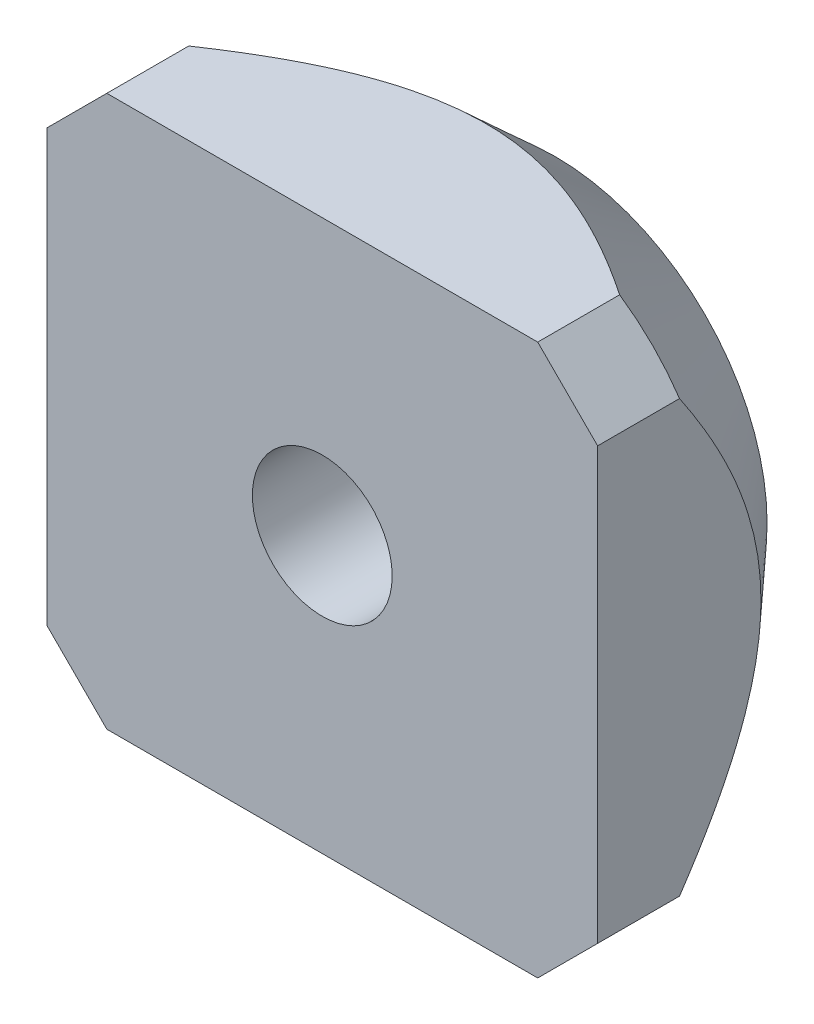
ISO-10303-21;
HEADER;
FILE_DESCRIPTION(('STEP AP214'),'2;1');
FILE_NAME('part.step','',(''),(''),'','','');
FILE_SCHEMA(('AUTOMOTIVE_DESIGN { 1 0 10303 214 1 1 1 1 }'));
ENDSEC;
DATA;
#1=APPLICATION_CONTEXT('core data for automotive mechanical design processes');
#2=APPLICATION_PROTOCOL_DEFINITION('international standard','automotive_design',2000,#1);
#3=PRODUCT_CONTEXT('',#1,'mechanical');
#4=PRODUCT('Part','Part','',(#3));
#5=PRODUCT_RELATED_PRODUCT_CATEGORY('part','',(#4));
#6=PRODUCT_DEFINITION_FORMATION('','',#4);
#7=PRODUCT_DEFINITION_CONTEXT('part definition',#1,'design');
#8=PRODUCT_DEFINITION('design','',#6,#7);
#9=PRODUCT_DEFINITION_SHAPE('','',#8);
#10=(LENGTH_UNIT() NAMED_UNIT(*) SI_UNIT(.MILLI.,.METRE.));
#11=(NAMED_UNIT(*) PLANE_ANGLE_UNIT() SI_UNIT($,.RADIAN.));
#12=(NAMED_UNIT(*) SI_UNIT($,.STERADIAN.) SOLID_ANGLE_UNIT());
#13=UNCERTAINTY_MEASURE_WITH_UNIT(LENGTH_MEASURE(1.E-05),#10,'distance_accuracy_value','');
#14=(GEOMETRIC_REPRESENTATION_CONTEXT(3) GLOBAL_UNCERTAINTY_ASSIGNED_CONTEXT((#13)) GLOBAL_UNIT_ASSIGNED_CONTEXT((#10,
#11,#12)) REPRESENTATION_CONTEXT('',''));
#15=CARTESIAN_POINT('',(0.,0.,0.));
#16=DIRECTION('',(0.,0.,1.));
#17=DIRECTION('',(1.,0.,0.));
#18=AXIS2_PLACEMENT_3D('',#15,#16,#17);
#19=CARTESIAN_POINT('',(0.,0.,-5.5));
#20=DIRECTION('',(0.,0.,1.));
#21=DIRECTION('',(1.,0.,0.));
#22=AXIS2_PLACEMENT_3D('',#19,#20,#21);
#23=PLANE('',#22);
#24=CARTESIAN_POINT('',(0.,0.,-5.5));
#25=DIRECTION('',(0.,0.,1.));
#26=DIRECTION('',(1.,0.,0.));
#27=AXIS2_PLACEMENT_3D('',#24,#25,#26);
#28=CIRCLE('',#27,1.65);
#29=CARTESIAN_POINT('',(1.65,0.,-5.5));
#30=VERTEX_POINT('',#29);
#31=EDGE_CURVE('E246',#30,#30,#28,.T.);
#32=ORIENTED_EDGE('',*,*,#31,.T.);
#33=EDGE_LOOP('',(#32));
#34=FACE_BOUND('',#33,.T.);
#35=CARTESIAN_POINT('',(0.,0.,-5.50000000287154));
#36=DIRECTION('',(0.,0.,1.));
#37=DIRECTION('',(1.,0.,0.));
#38=AXIS2_PLACEMENT_3D('',#35,#36,#37);
#39=CIRCLE('',#38,5.00000000314824);
#40=CARTESIAN_POINT('',(5.00000000314824,0.,-5.50000000287154));
#41=VERTEX_POINT('',#40);
#42=EDGE_CURVE('E33',#41,#41,#39,.T.);
#43=ORIENTED_EDGE('',*,*,#42,.F.);
#44=EDGE_LOOP('',(#43));
#45=FACE_BOUND('',#44,.T.);
#46=ADVANCED_FACE('F30',(#34,#45),#23,.F.);
#47=CARTESIAN_POINT('',(0.,0.,-1.91193420733516));
#48=DIRECTION('',(0.,0.,1.));
#49=DIRECTION('',(1.,0.,0.));
#50=AXIS2_PLACEMENT_3D('',#47,#48,#49);
#51=CONICAL_SURFACE('',#50,8.27271392518171,0.739466056088912);
#52=ORIENTED_EDGE('',*,*,#42,.T.);
#53=EDGE_LOOP('',(#52));
#54=FACE_BOUND('',#53,.T.);
#55=CARTESIAN_POINT('',(-6.49999999996656,5.08578643774263,-1.93333420218814));
#56=CARTESIAN_POINT('',(-6.49999999998799,4.97217656549041,-2.01007902749409));
#57=CARTESIAN_POINT('',(-6.49999999999678,4.85782950972393,-2.08574579284289));
#58=CARTESIAN_POINT('',(-6.50000000000322,4.62749756275461,-2.23459577320099));
#59=CARTESIAN_POINT('',(-6.50000000000086,4.51151233122406,-2.30777846107305));
#60=CARTESIAN_POINT('',(-6.49999999999913,4.27735001893202,-2.45156937006614));
#61=CARTESIAN_POINT('',(-6.49999999999976,4.15916634847437,-2.52216690472437));
#62=CARTESIAN_POINT('',(-6.50000000000024,3.92090179825337,-2.66006146574261));
#63=CARTESIAN_POINT('',(-6.50000000000008,3.80082102170299,-2.72735867084667));
#64=CARTESIAN_POINT('',(-6.49999999999983,3.43117049901182,-2.927024197621));
#65=CARTESIAN_POINT('',(-6.49999999999995,3.17828163281151,-3.05336340735418));
#66=CARTESIAN_POINT('',(-6.50000000000004,2.66320472724055,-3.2847897494762));
#67=CARTESIAN_POINT('',(-6.50000000000001,2.40103115726329,-3.38990837532806));
#68=CARTESIAN_POINT('',(-6.49999999999999,1.96194937878003,-3.54007016332442));
#69=CARTESIAN_POINT('',(-6.5,1.78780916432668,-3.5931930058844));
#70=CARTESIAN_POINT('',(-6.5,1.43593803357401,-3.68604206605222));
#71=CARTESIAN_POINT('',(-6.5,1.25820705951024,-3.72576806796325));
#72=CARTESIAN_POINT('',(-6.5,0.901971243864608,-3.78972854936986));
#73=CARTESIAN_POINT('',(-6.5,0.723496609813822,-3.81412921930872));
#74=CARTESIAN_POINT('',(-6.5,0.365074863040264,-3.84691624104865));
#75=CARTESIAN_POINT('',(-6.5,0.185127876429945,-3.85530395029257));
#76=CARTESIAN_POINT('',(-6.5,-0.175331996863656,-3.85561829853934));
#77=CARTESIAN_POINT('',(-6.5,-0.355844930170432,-3.84749448568778));
#78=CARTESIAN_POINT('',(-6.5,-0.715412000901114,-3.81512247996494));
#79=CARTESIAN_POINT('',(-6.5,-0.894466007670494,-3.79087285866508));
#80=CARTESIAN_POINT('',(-6.5,-1.25186987190293,-3.72710369302864));
#81=CARTESIAN_POINT('',(-6.5,-1.43018938883302,-3.6874161876482));
#82=CARTESIAN_POINT('',(-6.5,-1.7832209983363,-3.59454247061222));
#83=CARTESIAN_POINT('',(-6.5,-1.95793314761956,-3.54135647133646));
#84=CARTESIAN_POINT('',(-6.5,-2.39791270686289,-3.39110767153733));
#85=CARTESIAN_POINT('',(-6.5,-2.66041462883235,-3.2859613732665));
#86=CARTESIAN_POINT('',(-6.5,-3.17612601907367,-3.05441341529704));
#87=CARTESIAN_POINT('',(-6.5,-3.4293209389517,-2.92798006949308));
#88=CARTESIAN_POINT('',(-6.5,-3.79940591229883,-2.72814379751195));
#89=CARTESIAN_POINT('',(-6.5,-3.91962359960432,-2.66078705978884));
#90=CARTESIAN_POINT('',(-6.5,-4.15815744619399,-2.52276484072712));
#91=CARTESIAN_POINT('',(-6.5,-4.27647350172637,-2.45209917967338));
#92=CARTESIAN_POINT('',(-6.5,-4.510894297226,-2.30816632365151));
#93=CARTESIAN_POINT('',(-6.5,-4.62700566745187,-2.23490988206234));
#94=CARTESIAN_POINT('',(-6.5,-4.85758619181249,-2.08590677964123));
#95=CARTESIAN_POINT('',(-6.5,-4.97205568825616,-2.01016064904319));
#96=CARTESIAN_POINT('',(-6.5,-5.08578643774838,-1.93333420220499));
#97=B_SPLINE_CURVE_WITH_KNOTS('',3,(#55,#56,#57,#58,#59,#60,#61,#62,#63,#64,#65,#66,#67,#68,#69,
#70,#71,#72,#73,#74,#75,#76,#77,#78,#79,#80,#81,#82,#83,#84,#85,#86,#87,#88,#89,#90,#91,#92,#93,
#94,#95,#96),.UNSPECIFIED.,.F.,.F.,(4,2,2,2,2,2,2,2,2,2,2,2,2,2,2,2,2,2,2,2,4),(0.,
0.41131042679013,0.822707597462602,1.23564791332838,1.64856583981778,2.49590493844257,
3.34197710361053,3.88772071571207,4.43347311417834,4.97320018567055,5.51288150165221,
6.05421432221896,6.59559510058552,7.1430386002873,7.69047348727104,8.53748456918338,
9.38576777125056,9.79913116863559,10.2125170428237,10.6243522063669,11.0361002217524),.UNSPECIFIED.);
#98=CARTESIAN_POINT('',(-6.50000000001247,5.08578643767711,-1.93333420224238));
#99=VERTEX_POINT('',#98);
#100=CARTESIAN_POINT('',(-6.50000000001247,-5.08578643767711,-1.93333420224238));
#101=VERTEX_POINT('',#100);
#102=EDGE_CURVE('E159',#99,#101,#97,.T.);
#103=ORIENTED_EDGE('',*,*,#102,.F.);
#104=CARTESIAN_POINT('',(-5.08578643758324,6.50000000000418,-1.93333420227152));
#105=CARTESIAN_POINT('',(-5.20320338743552,6.38258305017716,-1.95544496406807));
#106=CARTESIAN_POINT('',(-5.32114245529566,6.26464398232743,-1.97213629505099));
#107=CARTESIAN_POINT('',(-5.55702028333326,6.02876615429746,-1.99438943436884));
#108=CARTESIAN_POINT('',(-5.6749567510727,5.9108296865553,-2.00000000038364));
#109=CARTESIAN_POINT('',(-5.91082968655301,5.67495675107281,-2.00000000038308));
#110=CARTESIAN_POINT('',(-6.02876615429389,5.55702028333248,-1.99438943436772));
#111=CARTESIAN_POINT('',(-6.2646439823281,5.32114245529936,-1.97213629505239));
#112=CARTESIAN_POINT('',(-6.38258305018337,5.20320338744464,-1.95544496407257));
#113=CARTESIAN_POINT('',(-6.50000000002287,5.08578643760404,-1.93333420228277));
#114=B_SPLINE_CURVE_WITH_KNOTS('',3,(#104,#105,#106,#107,#108,#109,#110,#111,#112,#113),
.UNSPECIFIED.,.F.,.F.,(4,2,2,2,4),(0.,0.502492195093159,1.00276834929097,1.50304450348823,
2.00553669858084),.UNSPECIFIED.);
#115=CARTESIAN_POINT('',(-5.08578643767711,6.50000000001248,-1.93333420224238));
#116=VERTEX_POINT('',#115);
#117=EDGE_CURVE('E165',#116,#99,#114,.T.);
#118=ORIENTED_EDGE('',*,*,#117,.F.);
#119=CARTESIAN_POINT('',(5.08578643774263,6.49999999996657,-1.93333420218813));
#120=CARTESIAN_POINT('',(4.9721765654904,6.49999999998799,-2.01007902749409));
#121=CARTESIAN_POINT('',(4.85782950972392,6.49999999999678,-2.08574579284289));
#122=CARTESIAN_POINT('',(4.62749756275461,6.50000000000322,-2.23459577320099));
#123=CARTESIAN_POINT('',(4.51151233122406,6.50000000000087,-2.30777846107305));
#124=CARTESIAN_POINT('',(4.27735001893202,6.49999999999913,-2.45156937006614));
#125=CARTESIAN_POINT('',(4.15916634847437,6.49999999999976,-2.52216690472436));
#126=CARTESIAN_POINT('',(3.92090179825336,6.50000000000024,-2.66006146574261));
#127=CARTESIAN_POINT('',(3.80082102170299,6.50000000000009,-2.72735867084667));
#128=CARTESIAN_POINT('',(3.43117049901181,6.49999999999983,-2.927024197621));
#129=CARTESIAN_POINT('',(3.17828163281151,6.49999999999996,-3.05336340735418));
#130=CARTESIAN_POINT('',(2.66320472724054,6.50000000000005,-3.2847897494762));
#131=CARTESIAN_POINT('',(2.40103115726328,6.50000000000001,-3.38990837532806));
#132=CARTESIAN_POINT('',(1.96194937878002,6.5,-3.54007016332442));
#133=CARTESIAN_POINT('',(1.78780916432667,6.5,-3.5931930058844));
#134=CARTESIAN_POINT('',(1.435938033574,6.50000000000001,-3.68604206605221));
#135=CARTESIAN_POINT('',(1.25820705951023,6.5,-3.72576806796325));
#136=CARTESIAN_POINT('',(0.901971243864601,6.5,-3.78972854936986));
#137=CARTESIAN_POINT('',(0.723496609813815,6.5,-3.81412921930872));
#138=CARTESIAN_POINT('',(0.365074863040257,6.5,-3.84691624104865));
#139=CARTESIAN_POINT('',(0.185127876429939,6.5,-3.85530395029256));
#140=CARTESIAN_POINT('',(-0.175331996863662,6.5,-3.85561829853934));
#141=CARTESIAN_POINT('',(-0.355844930170438,6.5,-3.84749448568778));
#142=CARTESIAN_POINT('',(-0.715412000901119,6.5,-3.81512247996494));
#143=CARTESIAN_POINT('',(-0.8944660076705,6.5,-3.79087285866508));
#144=CARTESIAN_POINT('',(-1.25186987190293,6.5,-3.72710369302863));
#145=CARTESIAN_POINT('',(-1.43018938883303,6.5,-3.68741618764819));
#146=CARTESIAN_POINT('',(-1.7832209983363,6.5,-3.59454247061221));
#147=CARTESIAN_POINT('',(-1.95793314761956,6.5,-3.54135647133646));
#148=CARTESIAN_POINT('',(-2.3979127068629,6.5,-3.39110767153733));
#149=CARTESIAN_POINT('',(-2.66041462883235,6.5,-3.2859613732665));
#150=CARTESIAN_POINT('',(-3.17612601907368,6.5,-3.05441341529704));
#151=CARTESIAN_POINT('',(-3.4293209389517,6.5,-2.92798006949307));
#152=CARTESIAN_POINT('',(-3.79940591229883,6.5,-2.72814379751195));
#153=CARTESIAN_POINT('',(-3.91962359960432,6.5,-2.66078705978884));
#154=CARTESIAN_POINT('',(-4.15815744619399,6.5,-2.52276484072712));
#155=CARTESIAN_POINT('',(-4.27647350172636,6.5,-2.45209917967338));
#156=CARTESIAN_POINT('',(-4.510894297226,6.5,-2.30816632365151));
#157=CARTESIAN_POINT('',(-4.62700566745187,6.5,-2.23490988206234));
#158=CARTESIAN_POINT('',(-4.85758619181248,6.5,-2.08590677964123));
#159=CARTESIAN_POINT('',(-4.97205568825616,6.5,-2.01016064904319));
#160=CARTESIAN_POINT('',(-5.08578643774838,6.5,-1.93333420220499));
#161=B_SPLINE_CURVE_WITH_KNOTS('',3,(#119,#120,#121,#122,#123,#124,#125,#126,#127,#128,#129,
#130,#131,#132,#133,#134,#135,#136,#137,#138,#139,#140,#141,#142,#143,#144,#145,#146,#147,#148,
#149,#150,#151,#152,#153,#154,#155,#156,#157,#158,#159,#160),.UNSPECIFIED.,.F.,.F.,(4,2,2,2,2,2,
2,2,2,2,2,2,2,2,2,2,2,2,2,2,4),(0.,0.411310426790131,0.822707597462601,1.23564791332838,
1.64856583981778,2.49590493844257,3.34197710361053,3.88772071571208,4.43347311417834,
4.97320018567055,5.51288150165221,6.05421432221896,6.59559510058552,7.1430386002873,
7.69047348727104,8.53748456918337,9.38576777125056,9.79913116863558,10.2125170428237,
10.6243522063669,11.0361002217524),.UNSPECIFIED.);
#162=CARTESIAN_POINT('',(5.08578643767711,6.50000000001247,-1.93333420224238));
#163=VERTEX_POINT('',#162);
#164=EDGE_CURVE('E99',#163,#116,#161,.T.);
#165=ORIENTED_EDGE('',*,*,#164,.F.);
#166=CARTESIAN_POINT('',(6.50000000000418,5.08578643758324,-1.93333420227152));
#167=CARTESIAN_POINT('',(6.38258305017715,5.20320338743553,-1.95544496406807));
#168=CARTESIAN_POINT('',(6.26464398232743,5.32114245529566,-1.97213629505098));
#169=CARTESIAN_POINT('',(6.02876615429745,5.55702028333326,-1.99438943436883));
#170=CARTESIAN_POINT('',(5.9108296865553,5.6749567510727,-2.00000000038364));
#171=CARTESIAN_POINT('',(5.67495675107281,5.91082968655302,-2.00000000038307));
#172=CARTESIAN_POINT('',(5.55702028333247,6.02876615429389,-1.99438943436771));
#173=CARTESIAN_POINT('',(5.32114245529936,6.2646439823281,-1.97213629505239));
#174=CARTESIAN_POINT('',(5.20320338744464,6.38258305018337,-1.95544496407257));
#175=CARTESIAN_POINT('',(5.08578643760404,6.50000000002287,-1.93333420228276));
#176=B_SPLINE_CURVE_WITH_KNOTS('',3,(#166,#167,#168,#169,#170,#171,#172,#173,#174,#175),
.UNSPECIFIED.,.F.,.F.,(4,2,2,2,4),(0.,0.502492195093158,1.00276834929097,1.50304450348823,
2.00553669858084),.UNSPECIFIED.);
#177=CARTESIAN_POINT('',(6.50000000001247,5.08578643761444,-1.93333420228472));
#178=VERTEX_POINT('',#177);
#179=EDGE_CURVE('E93',#178,#163,#176,.T.);
#180=ORIENTED_EDGE('',*,*,#179,.F.);
#181=CARTESIAN_POINT('',(6.49999999996656,-5.08578643774263,-1.93333420218813));
#182=CARTESIAN_POINT('',(6.49999999998799,-4.97217656549041,-2.01007902749409));
#183=CARTESIAN_POINT('',(6.49999999999678,-4.85782950972392,-2.08574579284288));
#184=CARTESIAN_POINT('',(6.50000000000322,-4.62749756275461,-2.23459577320098));
#185=CARTESIAN_POINT('',(6.50000000000087,-4.51151233122406,-2.30777846107305));
#186=CARTESIAN_POINT('',(6.49999999999913,-4.27735001893202,-2.45156937006614));
#187=CARTESIAN_POINT('',(6.49999999999976,-4.15916634847437,-2.52216690472436));
#188=CARTESIAN_POINT('',(6.50000000000024,-3.92090179825336,-2.6600614657426));
#189=CARTESIAN_POINT('',(6.50000000000008,-3.80082102170299,-2.72735867084666));
#190=CARTESIAN_POINT('',(6.49999999999983,-3.43117049901182,-2.927024197621));
#191=CARTESIAN_POINT('',(6.49999999999996,-3.17828163281151,-3.05336340735417));
#192=CARTESIAN_POINT('',(6.50000000000005,-2.66320472724054,-3.2847897494762));
#193=CARTESIAN_POINT('',(6.50000000000001,-2.40103115726328,-3.38990837532806));
#194=CARTESIAN_POINT('',(6.49999999999999,-1.96194937878003,-3.54007016332441));
#195=CARTESIAN_POINT('',(6.5,-1.78780916432667,-3.5931930058844));
#196=CARTESIAN_POINT('',(6.5,-1.435938033574,-3.68604206605221));
#197=CARTESIAN_POINT('',(6.5,-1.25820705951023,-3.72576806796324));
#198=CARTESIAN_POINT('',(6.5,-0.901971243864601,-3.78972854936985));
#199=CARTESIAN_POINT('',(6.5,-0.723496609813815,-3.81412921930872));
#200=CARTESIAN_POINT('',(6.5,-0.365074863040257,-3.84691624104865));
#201=CARTESIAN_POINT('',(6.5,-0.185127876429938,-3.85530395029256));
#202=CARTESIAN_POINT('',(6.5,0.175331996863663,-3.85561829853934));
#203=CARTESIAN_POINT('',(6.5,0.355844930170439,-3.84749448568778));
#204=CARTESIAN_POINT('',(6.5,0.715412000901121,-3.81512247996494));
#205=CARTESIAN_POINT('',(6.5,0.894466007670502,-3.79087285866508));
#206=CARTESIAN_POINT('',(6.5,1.25186987190294,-3.72710369302863));
#207=CARTESIAN_POINT('',(6.5,1.43018938883303,-3.68741618764819));
#208=CARTESIAN_POINT('',(6.5,1.7832209983363,-3.59454247061221));
#209=CARTESIAN_POINT('',(6.5,1.95793314761957,-3.54135647133646));
#210=CARTESIAN_POINT('',(6.5,2.3979127068629,-3.39110767153733));
#211=CARTESIAN_POINT('',(6.5,2.66041462883236,-3.2859613732665));
#212=CARTESIAN_POINT('',(6.5,3.17612601907368,-3.05441341529703));
#213=CARTESIAN_POINT('',(6.5,3.42932093895171,-2.92798006949307));
#214=CARTESIAN_POINT('',(6.5,3.79940591229883,-2.72814379751194));
#215=CARTESIAN_POINT('',(6.5,3.91962359960432,-2.66078705978883));
#216=CARTESIAN_POINT('',(6.5,4.15815744619399,-2.52276484072711));
#217=CARTESIAN_POINT('',(6.5,4.27647350172637,-2.45209917967337));
#218=CARTESIAN_POINT('',(6.5,4.51089429722601,-2.30816632365151));
#219=CARTESIAN_POINT('',(6.5,4.62700566745188,-2.23490988206234));
#220=CARTESIAN_POINT('',(6.5,4.85758619181249,-2.08590677964122));
#221=CARTESIAN_POINT('',(6.5,4.97205568825616,-2.01016064904319));
#222=CARTESIAN_POINT('',(6.5,5.08578643774839,-1.93333420220499));
#223=B_SPLINE_CURVE_WITH_KNOTS('',3,(#181,#182,#183,#184,#185,#186,#187,#188,#189,#190,#191,
#192,#193,#194,#195,#196,#197,#198,#199,#200,#201,#202,#203,#204,#205,#206,#207,#208,#209,#210,
#211,#212,#213,#214,#215,#216,#217,#218,#219,#220,#221,#222),.UNSPECIFIED.,.F.,.F.,(4,2,2,2,2,2,
2,2,2,2,2,2,2,2,2,2,2,2,2,2,4),(0.,0.411310426790131,0.822707597462602,1.23564791332838,
1.64856583981778,2.49590493844257,3.34197710361053,3.88772071571208,4.43347311417835,
4.97320018567056,5.51288150165222,6.05421432221896,6.59559510058553,7.14303860028731,
7.69047348727105,8.53748456918338,9.38576777125057,9.79913116863559,10.2125170428237,
10.6243522063669,11.0361002217524),.UNSPECIFIED.);
#224=CARTESIAN_POINT('',(6.50000000001247,-5.08578643767711,-1.93333420224237));
#225=VERTEX_POINT('',#224);
#226=EDGE_CURVE('E97',#225,#178,#223,.T.);
#227=ORIENTED_EDGE('',*,*,#226,.F.);
#228=CARTESIAN_POINT('',(5.08578643758324,-6.50000000000418,-1.93333420227152));
#229=CARTESIAN_POINT('',(5.20320338743552,-6.38258305017716,-1.95544496406807));
#230=CARTESIAN_POINT('',(5.32114245529566,-6.26464398232743,-1.97213629505098));
#231=CARTESIAN_POINT('',(5.55702028333326,-6.02876615429746,-1.99438943436883));
#232=CARTESIAN_POINT('',(5.6749567510727,-5.9108296865553,-2.00000000038364));
#233=CARTESIAN_POINT('',(5.91082968655301,-5.67495675107281,-2.00000000038307));
#234=CARTESIAN_POINT('',(6.02876615429389,-5.55702028333248,-1.99438943436771));
#235=CARTESIAN_POINT('',(6.2646439823281,-5.32114245529936,-1.97213629505238));
#236=CARTESIAN_POINT('',(6.38258305018337,-5.20320338744464,-1.95544496407256));
#237=CARTESIAN_POINT('',(6.50000000002286,-5.08578643760405,-1.93333420228276));
#238=B_SPLINE_CURVE_WITH_KNOTS('',3,(#228,#229,#230,#231,#232,#233,#234,#235,#236,#237),
.UNSPECIFIED.,.F.,.F.,(4,2,2,2,4),(0.,0.502492195093158,1.00276834929097,1.50304450348823,
2.00553669858084),.UNSPECIFIED.);
#239=CARTESIAN_POINT('',(5.08578643767711,-6.50000000001247,-1.93333420224237));
#240=VERTEX_POINT('',#239);
#241=EDGE_CURVE('E113',#240,#225,#238,.T.);
#242=ORIENTED_EDGE('',*,*,#241,.F.);
#243=CARTESIAN_POINT('',(-5.08578643774262,-6.49999999996657,-1.93333420218813));
#244=CARTESIAN_POINT('',(-4.9721765654904,-6.49999999998799,-2.01007902749409));
#245=CARTESIAN_POINT('',(-4.85782950972392,-6.49999999999678,-2.08574579284288));
#246=CARTESIAN_POINT('',(-4.62749756275461,-6.50000000000322,-2.23459577320099));
#247=CARTESIAN_POINT('',(-4.51151233122405,-6.50000000000087,-2.30777846107305));
#248=CARTESIAN_POINT('',(-4.27735001893202,-6.49999999999913,-2.45156937006614));
#249=CARTESIAN_POINT('',(-4.15916634847437,-6.49999999999976,-2.52216690472436));
#250=CARTESIAN_POINT('',(-3.92090179825336,-6.50000000000024,-2.6600614657426));
#251=CARTESIAN_POINT('',(-3.80082102170298,-6.50000000000009,-2.72735867084667));
#252=CARTESIAN_POINT('',(-3.43117049901181,-6.49999999999983,-2.927024197621));
#253=CARTESIAN_POINT('',(-3.1782816328115,-6.49999999999996,-3.05336340735418));
#254=CARTESIAN_POINT('',(-2.66320472724054,-6.50000000000005,-3.2847897494762));
#255=CARTESIAN_POINT('',(-2.40103115726328,-6.50000000000001,-3.38990837532806));
#256=CARTESIAN_POINT('',(-1.96194937878002,-6.5,-3.54007016332441));
#257=CARTESIAN_POINT('',(-1.78780916432667,-6.5,-3.5931930058844));
#258=CARTESIAN_POINT('',(-1.435938033574,-6.5,-3.68604206605221));
#259=CARTESIAN_POINT('',(-1.25820705951023,-6.5,-3.72576806796324));
#260=CARTESIAN_POINT('',(-0.9019712438646,-6.5,-3.78972854936985));
#261=CARTESIAN_POINT('',(-0.723496609813814,-6.5,-3.81412921930872));
#262=CARTESIAN_POINT('',(-0.365074863040256,-6.5,-3.84691624104865));
#263=CARTESIAN_POINT('',(-0.185127876429937,-6.5,-3.85530395029256));
#264=CARTESIAN_POINT('',(0.175331996863664,-6.5,-3.85561829853933));
#265=CARTESIAN_POINT('',(0.35584493017044,-6.5,-3.84749448568777));
#266=CARTESIAN_POINT('',(0.715412000901122,-6.5,-3.81512247996493));
#267=CARTESIAN_POINT('',(0.894466007670503,-6.5,-3.79087285866508));
#268=CARTESIAN_POINT('',(1.25186987190294,-6.5,-3.72710369302863));
#269=CARTESIAN_POINT('',(1.43018938883303,-6.5,-3.68741618764819));
#270=CARTESIAN_POINT('',(1.7832209983363,-6.5,-3.59454247061221));
#271=CARTESIAN_POINT('',(1.95793314761957,-6.5,-3.54135647133645));
#272=CARTESIAN_POINT('',(2.3979127068629,-6.5,-3.39110767153732));
#273=CARTESIAN_POINT('',(2.66041462883236,-6.5,-3.28596137326649));
#274=CARTESIAN_POINT('',(3.17612601907368,-6.5,-3.05441341529703));
#275=CARTESIAN_POINT('',(3.42932093895171,-6.5,-2.92798006949307));
#276=CARTESIAN_POINT('',(3.79940591229883,-6.5,-2.72814379751194));
#277=CARTESIAN_POINT('',(3.91962359960432,-6.5,-2.66078705978883));
#278=CARTESIAN_POINT('',(4.15815744619399,-6.5,-2.52276484072711));
#279=CARTESIAN_POINT('',(4.27647350172637,-6.5,-2.45209917967337));
#280=CARTESIAN_POINT('',(4.510894297226,-6.5,-2.30816632365151));
#281=CARTESIAN_POINT('',(4.62700566745187,-6.5,-2.23490988206233));
#282=CARTESIAN_POINT('',(4.85758619181248,-6.5,-2.08590677964122));
#283=CARTESIAN_POINT('',(4.97205568825616,-6.5,-2.01016064904318));
#284=CARTESIAN_POINT('',(5.08578643774838,-6.5,-1.93333420220499));
#285=B_SPLINE_CURVE_WITH_KNOTS('',3,(#243,#244,#245,#246,#247,#248,#249,#250,#251,#252,#253,
#254,#255,#256,#257,#258,#259,#260,#261,#262,#263,#264,#265,#266,#267,#268,#269,#270,#271,#272,
#273,#274,#275,#276,#277,#278,#279,#280,#281,#282,#283,#284),.UNSPECIFIED.,.F.,.F.,(4,2,2,2,2,2,
2,2,2,2,2,2,2,2,2,2,2,2,2,2,4),(0.,0.411310426790131,0.822707597462601,1.23564791332838,
1.64856583981778,2.49590493844257,3.34197710361053,3.88772071571207,4.43347311417834,
4.97320018567055,5.51288150165221,6.05421432221896,6.59559510058552,7.1430386002873,
7.69047348727104,8.53748456918338,9.38576777125056,9.79913116863558,10.2125170428237,
10.6243522063669,11.0361002217524),.UNSPECIFIED.);
#286=CARTESIAN_POINT('',(-5.08578643767711,-6.50000000001247,-1.93333420224237));
#287=VERTEX_POINT('',#286);
#288=EDGE_CURVE('E146',#287,#240,#285,.T.);
#289=ORIENTED_EDGE('',*,*,#288,.F.);
#290=CARTESIAN_POINT('',(-6.50000000000418,-5.08578643758324,-1.93333420227152));
#291=CARTESIAN_POINT('',(-6.38258305017715,-5.20320338743553,-1.95544496406807));
#292=CARTESIAN_POINT('',(-6.26464398232743,-5.32114245529566,-1.97213629505099));
#293=CARTESIAN_POINT('',(-6.02876615429745,-5.55702028333326,-1.99438943436883));
#294=CARTESIAN_POINT('',(-5.9108296865553,-5.6749567510727,-2.00000000038364));
#295=CARTESIAN_POINT('',(-5.6749567510728,-5.91082968655301,-2.00000000038307));
#296=CARTESIAN_POINT('',(-5.55702028333247,-6.02876615429389,-1.99438943436771));
#297=CARTESIAN_POINT('',(-5.32114245529935,-6.2646439823281,-1.97213629505239));
#298=CARTESIAN_POINT('',(-5.20320338744463,-6.38258305018337,-1.95544496407257));
#299=CARTESIAN_POINT('',(-5.08578643760404,-6.50000000002287,-1.93333420228276));
#300=B_SPLINE_CURVE_WITH_KNOTS('',3,(#290,#291,#292,#293,#294,#295,#296,#297,#298,#299),
.UNSPECIFIED.,.F.,.F.,(4,2,2,2,4),(0.,0.50249219509316,1.00276834929097,1.50304450348824,
2.00553669858085),.UNSPECIFIED.);
#301=EDGE_CURVE('E153',#101,#287,#300,.T.);
#302=ORIENTED_EDGE('',*,*,#301,.F.);
#303=EDGE_LOOP('',(#103,#118,#165,#180,#227,#242,#289,#302));
#304=FACE_BOUND('',#303,.T.);
#305=ADVANCED_FACE('F95',(#54,#304),#51,.T.);
#306=CARTESIAN_POINT('',(6.5,5.08578643762691,0.));
#307=DIRECTION('',(0.707106781186548,0.707106781186548,0.));
#308=DIRECTION('',(-0.707106781186548,0.707106781186548,0.));
#309=AXIS2_PLACEMENT_3D('',#306,#307,#308);
#310=PLANE('',#309);
#311=DIRECTION('',(-0.707106781186547,0.707106781186547,0.));
#312=VECTOR('',#311,1.);
#313=CARTESIAN_POINT('',(6.5,5.08578643762691,0.));
#314=LINE('',#313,#312);
#315=CARTESIAN_POINT('',(6.5,5.08578643762691,0.));
#316=VERTEX_POINT('',#315);
#317=CARTESIAN_POINT('',(5.08578643762691,6.5,0.));
#318=VERTEX_POINT('',#317);
#319=EDGE_CURVE('E106',#316,#318,#314,.T.);
#320=ORIENTED_EDGE('',*,*,#319,.F.);
#321=DIRECTION('',(0.,0.,-1.));
#322=VECTOR('',#321,1.);
#323=CARTESIAN_POINT('',(6.5,5.08578643762691,0.));
#324=LINE('',#323,#322);
#325=EDGE_CURVE('E103',#178,#316,#324,.F.);
#326=ORIENTED_EDGE('',*,*,#325,.F.);
#327=ORIENTED_EDGE('',*,*,#179,.T.);
#328=DIRECTION('',(0.,0.,1.));
#329=VECTOR('',#328,1.);
#330=CARTESIAN_POINT('',(5.08578643762691,6.5,0.));
#331=LINE('',#330,#329);
#332=EDGE_CURVE('E172',#318,#163,#331,.F.);
#333=ORIENTED_EDGE('',*,*,#332,.F.);
#334=EDGE_LOOP('',(#320,#326,#327,#333));
#335=FACE_BOUND('',#334,.T.);
#336=ADVANCED_FACE('F104',(#335),#310,.T.);
#337=CARTESIAN_POINT('',(5.08578643762691,6.5,0.));
#338=DIRECTION('',(0.,1.,0.));
#339=DIRECTION('',(0.,0.,1.));
#340=AXIS2_PLACEMENT_3D('',#337,#338,#339);
#341=PLANE('',#340);
#342=DIRECTION('',(1.,0.,0.));
#343=VECTOR('',#342,1.);
#344=CARTESIAN_POINT('',(0.,6.5,0.));
#345=LINE('',#344,#343);
#346=CARTESIAN_POINT('',(-5.0857864376269,6.50000000000001,0.));
#347=VERTEX_POINT('',#346);
#348=EDGE_CURVE('E121',#318,#347,#345,.F.);
#349=ORIENTED_EDGE('',*,*,#348,.F.);
#350=ORIENTED_EDGE('',*,*,#332,.T.);
#351=ORIENTED_EDGE('',*,*,#164,.T.);
#352=DIRECTION('',(0.,0.,1.));
#353=VECTOR('',#352,1.);
#354=CARTESIAN_POINT('',(-5.0857864376269,6.50000000000001,0.));
#355=LINE('',#354,#353);
#356=EDGE_CURVE('E171',#347,#116,#355,.F.);
#357=ORIENTED_EDGE('',*,*,#356,.F.);
#358=EDGE_LOOP('',(#349,#350,#351,#357));
#359=FACE_BOUND('',#358,.T.);
#360=ADVANCED_FACE('F180',(#359),#341,.T.);
#361=CARTESIAN_POINT('',(-5.0857864376269,6.50000000000001,0.));
#362=DIRECTION('',(-0.707106781186548,0.707106781186548,0.));
#363=DIRECTION('',(-0.707106781186548,-0.707106781186548,0.));
#364=AXIS2_PLACEMENT_3D('',#361,#362,#363);
#365=PLANE('',#364);
#366=DIRECTION('',(-0.707106781186547,-0.707106781186547,0.));
#367=VECTOR('',#366,1.);
#368=CARTESIAN_POINT('',(-5.0857864376269,6.50000000000001,0.));
#369=LINE('',#368,#367);
#370=CARTESIAN_POINT('',(-6.5,5.08578643762691,0.));
#371=VERTEX_POINT('',#370);
#372=EDGE_CURVE('E219',#347,#371,#369,.T.);
#373=ORIENTED_EDGE('',*,*,#372,.F.);
#374=ORIENTED_EDGE('',*,*,#356,.T.);
#375=ORIENTED_EDGE('',*,*,#117,.T.);
#376=DIRECTION('',(0.,0.,1.));
#377=VECTOR('',#376,1.);
#378=CARTESIAN_POINT('',(-6.5,5.08578643762691,0.));
#379=LINE('',#378,#377);
#380=EDGE_CURVE('E226',#371,#99,#379,.F.);
#381=ORIENTED_EDGE('',*,*,#380,.F.);
#382=EDGE_LOOP('',(#373,#374,#375,#381));
#383=FACE_BOUND('',#382,.T.);
#384=ADVANCED_FACE('F176',(#383),#365,.T.);
#385=CARTESIAN_POINT('',(-6.5,5.08578643762691,0.));
#386=DIRECTION('',(-1.,0.,0.));
#387=DIRECTION('',(0.,0.,1.));
#388=AXIS2_PLACEMENT_3D('',#385,#386,#387);
#389=PLANE('',#388);
#390=DIRECTION('',(0.,1.,0.));
#391=VECTOR('',#390,1.);
#392=CARTESIAN_POINT('',(-6.5,0.,0.));
#393=LINE('',#392,#391);
#394=CARTESIAN_POINT('',(-6.5,-5.08578643762691,0.));
#395=VERTEX_POINT('',#394);
#396=EDGE_CURVE('E217',#371,#395,#393,.F.);
#397=ORIENTED_EDGE('',*,*,#396,.F.);
#398=ORIENTED_EDGE('',*,*,#380,.T.);
#399=ORIENTED_EDGE('',*,*,#102,.T.);
#400=DIRECTION('',(0.,0.,1.));
#401=VECTOR('',#400,1.);
#402=CARTESIAN_POINT('',(-6.5,-5.08578643762691,0.));
#403=LINE('',#402,#401);
#404=EDGE_CURVE('E232',#395,#101,#403,.F.);
#405=ORIENTED_EDGE('',*,*,#404,.F.);
#406=EDGE_LOOP('',(#397,#398,#399,#405));
#407=FACE_BOUND('',#406,.T.);
#408=ADVANCED_FACE('F179',(#407),#389,.T.);
#409=CARTESIAN_POINT('',(-6.5,-5.08578643762691,0.));
#410=DIRECTION('',(-0.707106781186548,-0.707106781186548,0.));
#411=DIRECTION('',(0.707106781186548,-0.707106781186548,0.));
#412=AXIS2_PLACEMENT_3D('',#409,#410,#411);
#413=PLANE('',#412);
#414=DIRECTION('',(0.707106781186547,-0.707106781186548,0.));
#415=VECTOR('',#414,1.);
#416=CARTESIAN_POINT('',(-6.5,-5.08578643762691,0.));
#417=LINE('',#416,#415);
#418=CARTESIAN_POINT('',(-5.08578643762691,-6.5,0.));
#419=VERTEX_POINT('',#418);
#420=EDGE_CURVE('E211',#395,#419,#417,.T.);
#421=ORIENTED_EDGE('',*,*,#420,.F.);
#422=ORIENTED_EDGE('',*,*,#404,.T.);
#423=ORIENTED_EDGE('',*,*,#301,.T.);
#424=DIRECTION('',(0.,0.,-1.));
#425=VECTOR('',#424,1.);
#426=CARTESIAN_POINT('',(-5.08578643762691,-6.5,0.));
#427=LINE('',#426,#425);
#428=EDGE_CURVE('E238',#419,#287,#427,.T.);
#429=ORIENTED_EDGE('',*,*,#428,.F.);
#430=EDGE_LOOP('',(#421,#422,#423,#429));
#431=FACE_BOUND('',#430,.T.);
#432=ADVANCED_FACE('F235',(#431),#413,.T.);
#433=CARTESIAN_POINT('',(-5.08578643762691,-6.5,0.));
#434=DIRECTION('',(0.,-1.,0.));
#435=DIRECTION('',(0.,0.,-1.));
#436=AXIS2_PLACEMENT_3D('',#433,#434,#435);
#437=PLANE('',#436);
#438=DIRECTION('',(1.,0.,0.));
#439=VECTOR('',#438,1.);
#440=CARTESIAN_POINT('',(0.,-6.5,0.));
#441=LINE('',#440,#439);
#442=CARTESIAN_POINT('',(5.08578643762691,-6.5,0.));
#443=VERTEX_POINT('',#442);
#444=EDGE_CURVE('E209',#419,#443,#441,.T.);
#445=ORIENTED_EDGE('',*,*,#444,.F.);
#446=ORIENTED_EDGE('',*,*,#428,.T.);
#447=ORIENTED_EDGE('',*,*,#288,.T.);
#448=DIRECTION('',(0.,0.,1.));
#449=VECTOR('',#448,1.);
#450=CARTESIAN_POINT('',(5.08578643762691,-6.5,0.));
#451=LINE('',#450,#449);
#452=EDGE_CURVE('E110',#443,#240,#451,.F.);
#453=ORIENTED_EDGE('',*,*,#452,.F.);
#454=EDGE_LOOP('',(#445,#446,#447,#453));
#455=FACE_BOUND('',#454,.T.);
#456=ADVANCED_FACE('F242',(#455),#437,.T.);
#457=CARTESIAN_POINT('',(5.08578643762691,-6.5,0.));
#458=DIRECTION('',(0.707106781186548,-0.707106781186548,0.));
#459=DIRECTION('',(0.707106781186548,0.707106781186548,0.));
#460=AXIS2_PLACEMENT_3D('',#457,#458,#459);
#461=PLANE('',#460);
#462=DIRECTION('',(0.707106781186547,0.707106781186548,0.));
#463=VECTOR('',#462,1.);
#464=CARTESIAN_POINT('',(5.08578643762691,-6.5,0.));
#465=LINE('',#464,#463);
#466=CARTESIAN_POINT('',(6.5,-5.08578643762691,0.));
#467=VERTEX_POINT('',#466);
#468=EDGE_CURVE('E39',#443,#467,#465,.T.);
#469=ORIENTED_EDGE('',*,*,#468,.F.);
#470=ORIENTED_EDGE('',*,*,#452,.T.);
#471=ORIENTED_EDGE('',*,*,#241,.T.);
#472=DIRECTION('',(0.,0.,-1.));
#473=VECTOR('',#472,1.);
#474=CARTESIAN_POINT('',(6.5,-5.08578643762691,0.));
#475=LINE('',#474,#473);
#476=EDGE_CURVE('E48',#467,#225,#475,.T.);
#477=ORIENTED_EDGE('',*,*,#476,.F.);
#478=EDGE_LOOP('',(#469,#470,#471,#477));
#479=FACE_BOUND('',#478,.T.);
#480=ADVANCED_FACE('F200',(#479),#461,.T.);
#481=CARTESIAN_POINT('',(6.5,-5.08578643762691,0.));
#482=DIRECTION('',(1.,0.,0.));
#483=DIRECTION('',(0.,0.,-1.));
#484=AXIS2_PLACEMENT_3D('',#481,#482,#483);
#485=PLANE('',#484);
#486=DIRECTION('',(0.,1.,0.));
#487=VECTOR('',#486,1.);
#488=CARTESIAN_POINT('',(6.5,0.,0.));
#489=LINE('',#488,#487);
#490=EDGE_CURVE('E11',#467,#316,#489,.T.);
#491=ORIENTED_EDGE('',*,*,#490,.F.);
#492=ORIENTED_EDGE('',*,*,#476,.T.);
#493=ORIENTED_EDGE('',*,*,#226,.T.);
#494=ORIENTED_EDGE('',*,*,#325,.T.);
#495=EDGE_LOOP('',(#491,#492,#493,#494));
#496=FACE_BOUND('',#495,.T.);
#497=ADVANCED_FACE('F109',(#496),#485,.T.);
#498=CARTESIAN_POINT('',(0.,0.,0.));
#499=DIRECTION('',(0.,0.,1.));
#500=DIRECTION('',(1.,0.,0.));
#501=AXIS2_PLACEMENT_3D('',#498,#499,#500);
#502=PLANE('',#501);
#503=CARTESIAN_POINT('',(0.,0.,0.));
#504=DIRECTION('',(0.,0.,1.));
#505=DIRECTION('',(1.,0.,0.));
#506=AXIS2_PLACEMENT_3D('',#503,#504,#505);
#507=CIRCLE('',#506,1.65);
#508=CARTESIAN_POINT('',(1.65,0.,0.));
#509=VERTEX_POINT('',#508);
#510=EDGE_CURVE('E204',#509,#509,#507,.T.);
#511=ORIENTED_EDGE('',*,*,#510,.F.);
#512=EDGE_LOOP('',(#511));
#513=FACE_BOUND('',#512,.T.);
#514=ORIENTED_EDGE('',*,*,#468,.T.);
#515=ORIENTED_EDGE('',*,*,#490,.T.);
#516=ORIENTED_EDGE('',*,*,#319,.T.);
#517=ORIENTED_EDGE('',*,*,#348,.T.);
#518=ORIENTED_EDGE('',*,*,#372,.T.);
#519=ORIENTED_EDGE('',*,*,#396,.T.);
#520=ORIENTED_EDGE('',*,*,#420,.T.);
#521=ORIENTED_EDGE('',*,*,#444,.T.);
#522=EDGE_LOOP('',(#514,#515,#516,#517,#518,#519,#520,#521));
#523=FACE_BOUND('',#522,.T.);
#524=ADVANCED_FACE('F190',(#513,#523),#502,.T.);
#525=CARTESIAN_POINT('',(0.,0.,0.));
#526=DIRECTION('',(0.,0.,1.));
#527=DIRECTION('',(1.,0.,0.));
#528=AXIS2_PLACEMENT_3D('',#525,#526,#527);
#529=CYLINDRICAL_SURFACE('',#528,1.65);
#530=ORIENTED_EDGE('',*,*,#510,.T.);
#531=EDGE_LOOP('',(#530));
#532=FACE_BOUND('',#531,.T.);
#533=ORIENTED_EDGE('',*,*,#31,.F.);
#534=EDGE_LOOP('',(#533));
#535=FACE_BOUND('',#534,.T.);
#536=ADVANCED_FACE('F192',(#532,#535),#529,.F.);
#537=CLOSED_SHELL('',(#46,#305,#336,#360,#384,#408,#432,#456,#480,#497,#524,#536));
#538=MANIFOLD_SOLID_BREP('B2',#537);
#539=ADVANCED_BREP_SHAPE_REPRESENTATION('',(#18,#538),#14);
#540=SHAPE_DEFINITION_REPRESENTATION(#9,#539);
ENDSEC;
END-ISO-10303-21;
